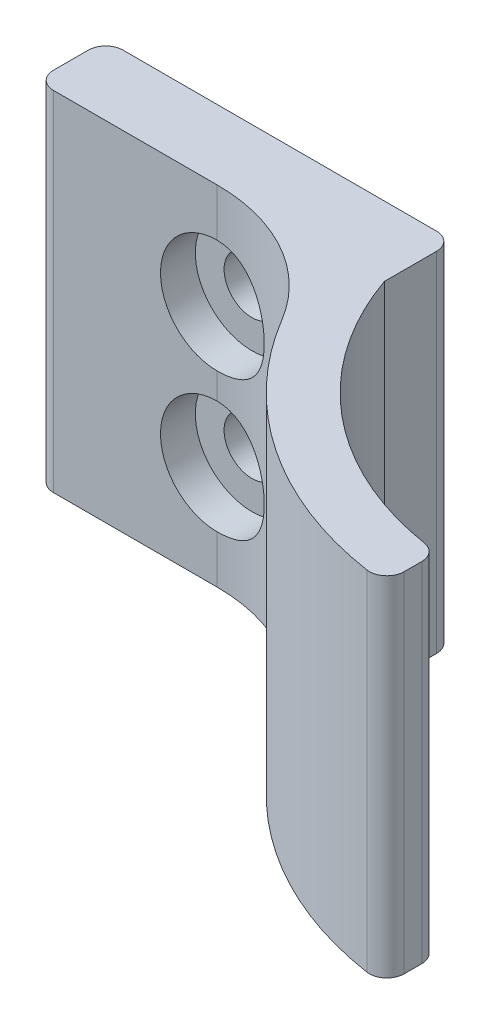
ISO-10303-21;
HEADER;
FILE_DESCRIPTION(('STEP AP214'),'2;1');
FILE_NAME('part.step','',(''),(''),'','','');
FILE_SCHEMA(('AUTOMOTIVE_DESIGN { 1 0 10303 214 1 1 1 1 }'));
ENDSEC;
DATA;
#1=APPLICATION_CONTEXT('core data for automotive mechanical design processes');
#2=APPLICATION_PROTOCOL_DEFINITION('international standard','automotive_design',2000,#1);
#3=PRODUCT_CONTEXT('',#1,'mechanical');
#4=PRODUCT('Part','Part','',(#3));
#5=PRODUCT_RELATED_PRODUCT_CATEGORY('part','',(#4));
#6=PRODUCT_DEFINITION_FORMATION('','',#4);
#7=PRODUCT_DEFINITION_CONTEXT('part definition',#1,'design');
#8=PRODUCT_DEFINITION('design','',#6,#7);
#9=PRODUCT_DEFINITION_SHAPE('','',#8);
#10=(LENGTH_UNIT() NAMED_UNIT(*) SI_UNIT(.MILLI.,.METRE.));
#11=(NAMED_UNIT(*) PLANE_ANGLE_UNIT() SI_UNIT($,.RADIAN.));
#12=(NAMED_UNIT(*) SI_UNIT($,.STERADIAN.) SOLID_ANGLE_UNIT());
#13=UNCERTAINTY_MEASURE_WITH_UNIT(LENGTH_MEASURE(1.E-05),#10,'distance_accuracy_value','');
#14=(GEOMETRIC_REPRESENTATION_CONTEXT(3) GLOBAL_UNCERTAINTY_ASSIGNED_CONTEXT((#13)) GLOBAL_UNIT_ASSIGNED_CONTEXT((#10,
#11,#12)) REPRESENTATION_CONTEXT('',''));
#15=CARTESIAN_POINT('',(0.,0.,0.));
#16=DIRECTION('',(0.,0.,1.));
#17=DIRECTION('',(1.,0.,0.));
#18=AXIS2_PLACEMENT_3D('',#15,#16,#17);
#19=CARTESIAN_POINT('',(17.,20.,-5.91607978309961));
#20=DIRECTION('',(0.,-1.,0.));
#21=DIRECTION('',(0.,0.,-1.));
#22=AXIS2_PLACEMENT_3D('',#19,#20,#21);
#23=CYLINDRICAL_SURFACE('',#22,18.);
#24=CARTESIAN_POINT('',(17.,0.,-5.91607978309961));
#25=DIRECTION('',(0.,-1.,0.));
#26=DIRECTION('',(0.,0.,1.));
#27=AXIS2_PLACEMENT_3D('',#24,#25,#26);
#28=CIRCLE('',#27,18.);
#29=CARTESIAN_POINT('',(14.1578947368421,0.,11.8581273067576));
#30=VERTEX_POINT('',#29);
#31=CARTESIAN_POINT('',(0.,0.,0.));
#32=VERTEX_POINT('',#31);
#33=EDGE_CURVE('E241',#30,#32,#28,.T.);
#34=ORIENTED_EDGE('',*,*,#33,.T.);
#35=DIRECTION('',(0.,-1.,0.));
#36=VECTOR('',#35,1.);
#37=CARTESIAN_POINT('',(0.,20.,0.));
#38=LINE('',#37,#36);
#39=CARTESIAN_POINT('',(0.,20.,0.));
#40=VERTEX_POINT('',#39);
#41=EDGE_CURVE('E335',#40,#32,#38,.T.);
#42=ORIENTED_EDGE('',*,*,#41,.F.);
#43=CARTESIAN_POINT('',(17.,20.,-5.91607978309961));
#44=DIRECTION('',(0.,-1.,0.));
#45=DIRECTION('',(0.,0.,1.));
#46=AXIS2_PLACEMENT_3D('',#43,#44,#45);
#47=CIRCLE('',#46,18.);
#48=CARTESIAN_POINT('',(14.1578947368421,20.,11.8581273067576));
#49=VERTEX_POINT('',#48);
#50=EDGE_CURVE('E207',#49,#40,#47,.T.);
#51=ORIENTED_EDGE('',*,*,#50,.F.);
#52=DIRECTION('',(0.,-1.,0.));
#53=VECTOR('',#52,1.);
#54=CARTESIAN_POINT('',(14.1578947368421,20.,11.8581273067576));
#55=LINE('',#54,#53);
#56=EDGE_CURVE('E199',#49,#30,#55,.T.);
#57=ORIENTED_EDGE('',*,*,#56,.T.);
#58=EDGE_LOOP('',(#34,#42,#51,#57));
#59=FACE_BOUND('',#58,.T.);
#60=ADVANCED_FACE('F39',(#59),#23,.F.);
#61=CARTESIAN_POINT('',(0.,20.,0.));
#62=DIRECTION('',(-1.,0.,0.));
#63=DIRECTION('',(0.,0.,1.));
#64=AXIS2_PLACEMENT_3D('',#61,#62,#63);
#65=PLANE('',#64);
#66=DIRECTION('',(0.,0.,-1.));
#67=VECTOR('',#66,1.);
#68=CARTESIAN_POINT('',(0.,0.,0.));
#69=LINE('',#68,#67);
#70=CARTESIAN_POINT('',(0.,0.,-2.99999999999999));
#71=VERTEX_POINT('',#70);
#72=EDGE_CURVE('E238',#32,#71,#69,.T.);
#73=ORIENTED_EDGE('',*,*,#72,.T.);
#74=DIRECTION('',(0.,-1.,0.));
#75=VECTOR('',#74,1.);
#76=CARTESIAN_POINT('',(0.,20.,-2.99999999999999));
#77=LINE('',#76,#75);
#78=CARTESIAN_POINT('',(0.,20.,-2.99999999999999));
#79=VERTEX_POINT('',#78);
#80=EDGE_CURVE('E346',#79,#71,#77,.T.);
#81=ORIENTED_EDGE('',*,*,#80,.F.);
#82=DIRECTION('',(0.,0.,-1.));
#83=VECTOR('',#82,1.);
#84=CARTESIAN_POINT('',(0.,20.,0.));
#85=LINE('',#84,#83);
#86=EDGE_CURVE('E276',#40,#79,#85,.T.);
#87=ORIENTED_EDGE('',*,*,#86,.F.);
#88=ORIENTED_EDGE('',*,*,#41,.T.);
#89=EDGE_LOOP('',(#73,#81,#87,#88));
#90=FACE_BOUND('',#89,.T.);
#91=ADVANCED_FACE('F324',(#90),#65,.F.);
#92=CARTESIAN_POINT('',(-1.,20.,-3.));
#93=DIRECTION('',(0.,-1.,0.));
#94=DIRECTION('',(0.,0.,-1.));
#95=AXIS2_PLACEMENT_3D('',#92,#93,#94);
#96=CYLINDRICAL_SURFACE('',#95,1.);
#97=CARTESIAN_POINT('',(-1.,0.,-3.));
#98=DIRECTION('',(0.,1.,0.));
#99=DIRECTION('',(0.,0.,1.));
#100=AXIS2_PLACEMENT_3D('',#97,#98,#99);
#101=CIRCLE('',#100,1.);
#102=CARTESIAN_POINT('',(-1.00000000000001,0.,-4.));
#103=VERTEX_POINT('',#102);
#104=EDGE_CURVE('E235',#71,#103,#101,.T.);
#105=ORIENTED_EDGE('',*,*,#104,.T.);
#106=DIRECTION('',(0.,-1.,0.));
#107=VECTOR('',#106,1.);
#108=CARTESIAN_POINT('',(-1.00000000000001,20.,-4.));
#109=LINE('',#108,#107);
#110=CARTESIAN_POINT('',(-1.00000000000001,20.,-4.));
#111=VERTEX_POINT('',#110);
#112=EDGE_CURVE('E350',#111,#103,#109,.T.);
#113=ORIENTED_EDGE('',*,*,#112,.F.);
#114=CARTESIAN_POINT('',(-1.,20.,-3.));
#115=DIRECTION('',(0.,1.,0.));
#116=DIRECTION('',(0.,0.,1.));
#117=AXIS2_PLACEMENT_3D('',#114,#115,#116);
#118=CIRCLE('',#117,1.);
#119=EDGE_CURVE('E273',#79,#111,#118,.T.);
#120=ORIENTED_EDGE('',*,*,#119,.F.);
#121=ORIENTED_EDGE('',*,*,#80,.T.);
#122=EDGE_LOOP('',(#105,#113,#120,#121));
#123=FACE_BOUND('',#122,.T.);
#124=ADVANCED_FACE('F329',(#123),#96,.T.);
#125=CARTESIAN_POINT('',(-1.00000000000001,20.,-4.));
#126=DIRECTION('',(0.,0.,1.));
#127=DIRECTION('',(1.,0.,0.));
#128=AXIS2_PLACEMENT_3D('',#125,#126,#127);
#129=PLANE('',#128);
#130=CARTESIAN_POINT('',(-9.60222555234821,14.,-4.));
#131=DIRECTION('',(0.,0.,1.));
#132=DIRECTION('',(1.,0.,0.));
#133=AXIS2_PLACEMENT_3D('',#130,#131,#132);
#134=CIRCLE('',#133,1.6);
#135=CARTESIAN_POINT('',(-8.00222555234821,14.,-4.));
#136=VERTEX_POINT('',#135);
#137=EDGE_CURVE('E162',#136,#136,#134,.T.);
#138=ORIENTED_EDGE('',*,*,#137,.T.);
#139=EDGE_LOOP('',(#138));
#140=FACE_BOUND('',#139,.T.);
#141=CARTESIAN_POINT('',(-9.60222555234821,6.,-4.));
#142=DIRECTION('',(0.,0.,1.));
#143=DIRECTION('',(1.,0.,0.));
#144=AXIS2_PLACEMENT_3D('',#141,#142,#143);
#145=CIRCLE('',#144,1.6);
#146=CARTESIAN_POINT('',(-8.00222555234821,6.,-4.));
#147=VERTEX_POINT('',#146);
#148=EDGE_CURVE('E284',#147,#147,#145,.T.);
#149=ORIENTED_EDGE('',*,*,#148,.T.);
#150=EDGE_LOOP('',(#149));
#151=FACE_BOUND('',#150,.T.);
#152=DIRECTION('',(-1.,0.,0.));
#153=VECTOR('',#152,1.);
#154=CARTESIAN_POINT('',(-1.00000000000001,0.,-4.));
#155=LINE('',#154,#153);
#156=CARTESIAN_POINT('',(-19.,0.,-4.));
#157=VERTEX_POINT('',#156);
#158=EDGE_CURVE('E232',#103,#157,#155,.T.);
#159=ORIENTED_EDGE('',*,*,#158,.T.);
#160=DIRECTION('',(0.,-1.,0.));
#161=VECTOR('',#160,1.);
#162=CARTESIAN_POINT('',(-19.,20.,-4.));
#163=LINE('',#162,#161);
#164=CARTESIAN_POINT('',(-19.,20.,-4.));
#165=VERTEX_POINT('',#164);
#166=EDGE_CURVE('E415',#165,#157,#163,.T.);
#167=ORIENTED_EDGE('',*,*,#166,.F.);
#168=DIRECTION('',(-1.,0.,0.));
#169=VECTOR('',#168,1.);
#170=CARTESIAN_POINT('',(-1.00000000000001,20.,-4.));
#171=LINE('',#170,#169);
#172=EDGE_CURVE('E270',#111,#165,#171,.T.);
#173=ORIENTED_EDGE('',*,*,#172,.F.);
#174=ORIENTED_EDGE('',*,*,#112,.T.);
#175=EDGE_LOOP('',(#159,#167,#173,#174));
#176=FACE_BOUND('',#175,.T.);
#177=ADVANCED_FACE('F425',(#140,#151,#176),#129,.F.);
#178=CARTESIAN_POINT('',(-19.,20.,-3.));
#179=DIRECTION('',(0.,-1.,0.));
#180=DIRECTION('',(0.,0.,-1.));
#181=AXIS2_PLACEMENT_3D('',#178,#179,#180);
#182=CYLINDRICAL_SURFACE('',#181,1.);
#183=CARTESIAN_POINT('',(-19.,0.,-3.));
#184=DIRECTION('',(0.,1.,0.));
#185=DIRECTION('',(0.,0.,1.));
#186=AXIS2_PLACEMENT_3D('',#183,#184,#185);
#187=CIRCLE('',#186,1.);
#188=CARTESIAN_POINT('',(-20.,0.,-2.99999999999999));
#189=VERTEX_POINT('',#188);
#190=EDGE_CURVE('E229',#157,#189,#187,.T.);
#191=ORIENTED_EDGE('',*,*,#190,.T.);
#192=DIRECTION('',(0.,-1.,0.));
#193=VECTOR('',#192,1.);
#194=CARTESIAN_POINT('',(-20.,20.,-2.99999999999999));
#195=LINE('',#194,#193);
#196=CARTESIAN_POINT('',(-20.,20.,-2.99999999999999));
#197=VERTEX_POINT('',#196);
#198=EDGE_CURVE('E411',#197,#189,#195,.T.);
#199=ORIENTED_EDGE('',*,*,#198,.F.);
#200=CARTESIAN_POINT('',(-19.,20.,-3.));
#201=DIRECTION('',(0.,1.,0.));
#202=DIRECTION('',(0.,0.,1.));
#203=AXIS2_PLACEMENT_3D('',#200,#201,#202);
#204=CIRCLE('',#203,1.);
#205=EDGE_CURVE('E267',#165,#197,#204,.T.);
#206=ORIENTED_EDGE('',*,*,#205,.F.);
#207=ORIENTED_EDGE('',*,*,#166,.T.);
#208=EDGE_LOOP('',(#191,#199,#206,#207));
#209=FACE_BOUND('',#208,.T.);
#210=ADVANCED_FACE('F432',(#209),#182,.T.);
#211=CARTESIAN_POINT('',(-20.,20.,-1.));
#212=DIRECTION('',(1.,0.,0.));
#213=DIRECTION('',(0.,0.,-1.));
#214=AXIS2_PLACEMENT_3D('',#211,#212,#213);
#215=PLANE('',#214);
#216=DIRECTION('',(0.,0.,1.));
#217=VECTOR('',#216,1.);
#218=CARTESIAN_POINT('',(-20.,0.,-1.));
#219=LINE('',#218,#217);
#220=CARTESIAN_POINT('',(-20.,0.,-1.));
#221=VERTEX_POINT('',#220);
#222=EDGE_CURVE('E226',#189,#221,#219,.T.);
#223=ORIENTED_EDGE('',*,*,#222,.T.);
#224=DIRECTION('',(0.,-1.,0.));
#225=VECTOR('',#224,1.);
#226=CARTESIAN_POINT('',(-20.,20.,-1.));
#227=LINE('',#226,#225);
#228=CARTESIAN_POINT('',(-20.,20.,-1.));
#229=VERTEX_POINT('',#228);
#230=EDGE_CURVE('E174',#229,#221,#227,.T.);
#231=ORIENTED_EDGE('',*,*,#230,.F.);
#232=DIRECTION('',(0.,0.,1.));
#233=VECTOR('',#232,1.);
#234=CARTESIAN_POINT('',(-20.,20.,-1.));
#235=LINE('',#234,#233);
#236=EDGE_CURVE('E264',#197,#229,#235,.T.);
#237=ORIENTED_EDGE('',*,*,#236,.F.);
#238=ORIENTED_EDGE('',*,*,#198,.T.);
#239=EDGE_LOOP('',(#223,#231,#237,#238));
#240=FACE_BOUND('',#239,.T.);
#241=ADVANCED_FACE('F434',(#240),#215,.F.);
#242=CARTESIAN_POINT('',(-19.,20.,-0.999999999999997));
#243=DIRECTION('',(0.,-1.,0.));
#244=DIRECTION('',(0.,0.,-1.));
#245=AXIS2_PLACEMENT_3D('',#242,#243,#244);
#246=CYLINDRICAL_SURFACE('',#245,1.);
#247=CARTESIAN_POINT('',(-19.,0.,-0.999999999999997));
#248=DIRECTION('',(0.,1.,0.));
#249=DIRECTION('',(0.,0.,1.));
#250=AXIS2_PLACEMENT_3D('',#247,#248,#249);
#251=CIRCLE('',#250,1.);
#252=CARTESIAN_POINT('',(-19.,0.,0.));
#253=VERTEX_POINT('',#252);
#254=EDGE_CURVE('E223',#221,#253,#251,.T.);
#255=ORIENTED_EDGE('',*,*,#254,.T.);
#256=DIRECTION('',(0.,-1.,0.));
#257=VECTOR('',#256,1.);
#258=CARTESIAN_POINT('',(-19.,20.,0.));
#259=LINE('',#258,#257);
#260=CARTESIAN_POINT('',(-19.,20.,0.));
#261=VERTEX_POINT('',#260);
#262=EDGE_CURVE('E168',#261,#253,#259,.T.);
#263=ORIENTED_EDGE('',*,*,#262,.F.);
#264=CARTESIAN_POINT('',(-19.,20.,-0.999999999999997));
#265=DIRECTION('',(0.,1.,0.));
#266=DIRECTION('',(0.,0.,1.));
#267=AXIS2_PLACEMENT_3D('',#264,#265,#266);
#268=CIRCLE('',#267,1.);
#269=EDGE_CURVE('E261',#229,#261,#268,.T.);
#270=ORIENTED_EDGE('',*,*,#269,.F.);
#271=ORIENTED_EDGE('',*,*,#230,.T.);
#272=EDGE_LOOP('',(#255,#263,#270,#271));
#273=FACE_BOUND('',#272,.T.);
#274=ADVANCED_FACE('F405',(#273),#246,.T.);
#275=CARTESIAN_POINT('',(-9.60222555234821,20.,0.));
#276=DIRECTION('',(0.,0.,-1.));
#277=DIRECTION('',(-1.,0.,0.));
#278=AXIS2_PLACEMENT_3D('',#275,#276,#277);
#279=PLANE('',#278);
#280=DIRECTION('',(0.,-1.,0.));
#281=VECTOR('',#280,1.);
#282=CARTESIAN_POINT('',(-9.60222555234821,20.,0.));
#283=LINE('',#282,#281);
#284=CARTESIAN_POINT('',(-9.60222555234821,10.75,0.));
#285=VERTEX_POINT('',#284);
#286=CARTESIAN_POINT('',(-9.6022255523482,9.25,0.));
#287=VERTEX_POINT('',#286);
#288=EDGE_CURVE('E159',#285,#287,#283,.T.);
#289=ORIENTED_EDGE('',*,*,#288,.F.);
#290=CARTESIAN_POINT('',(-9.60222555234821,14.,0.));
#291=DIRECTION('',(0.,0.,-1.));
#292=DIRECTION('',(-1.,0.,0.));
#293=AXIS2_PLACEMENT_3D('',#290,#291,#292);
#294=CIRCLE('',#293,3.25);
#295=CARTESIAN_POINT('',(-9.6022255523482,17.25,0.));
#296=VERTEX_POINT('',#295);
#297=EDGE_CURVE('E59',#285,#296,#294,.T.);
#298=ORIENTED_EDGE('',*,*,#297,.T.);
#299=CARTESIAN_POINT('',(-9.60222555234821,20.,0.));
#300=VERTEX_POINT('',#299);
#301=EDGE_CURVE('E157',#300,#296,#283,.T.);
#302=ORIENTED_EDGE('',*,*,#301,.F.);
#303=DIRECTION('',(1.,0.,0.));
#304=VECTOR('',#303,1.);
#305=CARTESIAN_POINT('',(-9.60222555234821,20.,0.));
#306=LINE('',#305,#304);
#307=EDGE_CURVE('E258',#261,#300,#306,.T.);
#308=ORIENTED_EDGE('',*,*,#307,.F.);
#309=ORIENTED_EDGE('',*,*,#262,.T.);
#310=DIRECTION('',(1.,0.,0.));
#311=VECTOR('',#310,1.);
#312=CARTESIAN_POINT('',(-9.60222555234821,0.,0.));
#313=LINE('',#312,#311);
#314=CARTESIAN_POINT('',(-9.60222555234821,0.,0.));
#315=VERTEX_POINT('',#314);
#316=EDGE_CURVE('E220',#253,#315,#313,.T.);
#317=ORIENTED_EDGE('',*,*,#316,.T.);
#318=CARTESIAN_POINT('',(-9.60222555234821,2.75,0.));
#319=VERTEX_POINT('',#318);
#320=EDGE_CURVE('E170',#319,#315,#283,.T.);
#321=ORIENTED_EDGE('',*,*,#320,.F.);
#322=CARTESIAN_POINT('',(-9.60222555234821,6.,0.));
#323=DIRECTION('',(0.,0.,-1.));
#324=DIRECTION('',(-1.,0.,0.));
#325=AXIS2_PLACEMENT_3D('',#322,#323,#324);
#326=CIRCLE('',#325,3.25);
#327=EDGE_CURVE('E65',#319,#287,#326,.T.);
#328=ORIENTED_EDGE('',*,*,#327,.T.);
#329=EDGE_LOOP('',(#289,#298,#302,#308,#309,#317,#321,#328));
#330=FACE_BOUND('',#329,.T.);
#331=ADVANCED_FACE('F155',(#330),#279,.F.);
#332=CARTESIAN_POINT('',(-9.6022255523482,20.,10.));
#333=DIRECTION('',(0.,-1.,0.));
#334=DIRECTION('',(0.,0.,-1.));
#335=AXIS2_PLACEMENT_3D('',#332,#333,#334);
#336=CYLINDRICAL_SURFACE('',#335,10.);
#337=ORIENTED_EDGE('',*,*,#301,.T.);
#338=CARTESIAN_POINT('',(-9.6022255523482,17.25,0.));
#339=CARTESIAN_POINT('',(-9.51329341857394,17.2500112513051,-1.11282264914781E-05));
#340=CARTESIAN_POINT('',(-9.42436827352336,17.2463499427884,0.00118607652276622));
#341=CARTESIAN_POINT('',(-9.24719660002003,17.2317695585319,0.00591437661247233));
#342=CARTESIAN_POINT('',(-9.15894992561175,17.220852090622,0.00944495491980726));
#343=CARTESIAN_POINT('',(-8.98398977741246,17.1918847345765,0.0187450735617407));
#344=CARTESIAN_POINT('',(-8.89727288731863,17.1738536424306,0.0245087128713515));
#345=CARTESIAN_POINT('',(-8.7257703103766,17.1308389775319,0.0381105907426012));
#346=CARTESIAN_POINT('',(-8.64098467087027,17.1058552345428,0.0459488801020304));
#347=CARTESIAN_POINT('',(-8.3904622302376,17.0207869190327,0.0722763218521159));
#348=CARTESIAN_POINT('',(-8.22833936515473,16.9505483294635,0.0935905361581963));
#349=CARTESIAN_POINT('',(-7.91821838046282,16.7852417878774,0.141559646535787));
#350=CARTESIAN_POINT('',(-7.77022699054168,16.6901620857607,0.168217068606139));
#351=CARTESIAN_POINT('',(-7.48762586695047,16.4745632729814,0.22503970914327));
#352=CARTESIAN_POINT('',(-7.35354355780084,16.3533729739643,0.25528554695048));
#353=CARTESIAN_POINT('',(-7.10720530342802,16.0904192167767,0.315424989463543));
#354=CARTESIAN_POINT('',(-6.99495487791784,15.948650571603,0.34531850330205));
#355=CARTESIAN_POINT('',(-6.79249587271183,15.6438597196631,0.402250049404965));
#356=CARTESIAN_POINT('',(-6.70296674113921,15.4803658139042,0.42918879553787));
#357=CARTESIAN_POINT('',(-6.55290386766946,15.1396322968542,0.475932568467015));
#358=CARTESIAN_POINT('',(-6.49236051062202,14.9623972664637,0.495739960332002));
#359=CARTESIAN_POINT('',(-6.40395344229763,14.6052258646278,0.52512922238866));
#360=CARTESIAN_POINT('',(-6.37509876130968,14.4255609567687,0.535020270951296));
#361=CARTESIAN_POINT('',(-6.34779091691797,14.0636848768588,0.544372934755628));
#362=CARTESIAN_POINT('',(-6.34932953992813,13.8814744060302,0.543837367720661));
#363=CARTESIAN_POINT('',(-6.38199411059323,13.5280338819998,0.532668652864772));
#364=CARTESIAN_POINT('',(-6.41184003555586,13.3566693598013,0.522472371493103));
#365=CARTESIAN_POINT('',(-6.4981883627115,13.021528311045,0.493844032955588));
#366=CARTESIAN_POINT('',(-6.55469349097933,12.8577525623695,0.47541113355283));
#367=CARTESIAN_POINT('',(-6.69362194383781,12.5394690606422,0.432065508437381));
#368=CARTESIAN_POINT('',(-6.77643391071219,12.3851445969725,0.407056655200444));
#369=CARTESIAN_POINT('',(-6.96535214961097,12.09217309776,0.353419166342113));
#370=CARTESIAN_POINT('',(-7.07146469616258,11.953530300341,0.324789556582834));
#371=CARTESIAN_POINT('',(-7.31017329563304,11.6886553593681,0.265406096653192));
#372=CARTESIAN_POINT('',(-7.44381842281442,11.563374219297,0.234617164205408));
#373=CARTESIAN_POINT('',(-7.73059429488194,11.3367443492728,0.17562044289375));
#374=CARTESIAN_POINT('',(-7.88373006723406,11.2354018134337,0.147413323227847));
#375=CARTESIAN_POINT('',(-8.20729240354845,11.0587622515606,0.0964088519237047));
#376=CARTESIAN_POINT('',(-8.37786962723737,10.9837222275642,0.0736655288042173));
#377=CARTESIAN_POINT('',(-8.64176868772571,10.8937651815659,0.0458343749978532));
#378=CARTESIAN_POINT('',(-8.73106181115526,10.867548599635,0.0376052888312919));
#379=CARTESIAN_POINT('',(-8.91172909202639,10.8228383037097,0.023457491865331));
#380=CARTESIAN_POINT('',(-9.00310230102589,10.8043411414837,0.0175377495691913));
#381=CARTESIAN_POINT('',(-9.17897030230539,10.7765614465614,0.00860906052130956));
#382=CARTESIAN_POINT('',(-9.26334858755738,10.7666022449501,0.00538697652915421));
#383=CARTESIAN_POINT('',(-9.43255711529449,10.7533220186246,0.00107953239249905));
#384=CARTESIAN_POINT('',(-9.51738653147617,10.7499914506591,-8.89953919593178E-06));
#385=CARTESIAN_POINT('',(-9.6022255523482,10.75,0.));
#386=B_SPLINE_CURVE_WITH_KNOTS('',3,(#338,#339,#340,#341,#342,#343,#344,#345,#346,#347,#348,
#349,#350,#351,#352,#353,#354,#355,#356,#357,#358,#359,#360,#361,#362,#363,#364,#365,#366,#367,
#368,#369,#370,#371,#372,#373,#374,#375,#376,#377,#378,#379,#380,#381,#382,#383,#384,#385),
.UNSPECIFIED.,.F.,.F.,(4,2,2,2,2,2,2,2,2,2,2,2,2,2,2,2,2,2,2,2,2,2,2,4),(0.,0.266701097613439,
0.533343118921864,0.799285273220844,1.06523393971388,1.59646784402707,2.12795348376492,
2.67521100352203,3.22260670599161,3.78483053108336,4.34686772605416,4.89077883063946,
5.43454294891666,5.95483514075891,6.47518054735533,7.00360176396624,7.53216545206592,
8.08683165940453,8.6416412297971,9.20172989144069,9.48170161367223,9.76154813952839,
10.0163424061384,10.2707695790362),.UNSPECIFIED.);
#387=EDGE_CURVE('E11',#296,#285,#386,.T.);
#388=ORIENTED_EDGE('',*,*,#387,.T.);
#389=ORIENTED_EDGE('',*,*,#288,.T.);
#390=CARTESIAN_POINT('',(-9.6022255523482,9.25,0.));
#391=CARTESIAN_POINT('',(-9.51329341857394,9.25001125130508,-1.11282264940276E-05));
#392=CARTESIAN_POINT('',(-9.42436827352336,9.24634994278835,0.00118607652276422));
#393=CARTESIAN_POINT('',(-9.24719660002003,9.23176955853191,0.0059143766124724));
#394=CARTESIAN_POINT('',(-9.15894992561175,9.22085209062202,0.00944495491980882));
#395=CARTESIAN_POINT('',(-8.98398977741246,9.19188473457652,0.018745073561741));
#396=CARTESIAN_POINT('',(-8.89727288731863,9.17385364243063,0.024508712871349));
#397=CARTESIAN_POINT('',(-8.7257703103766,9.13083897753194,0.0381105907425981));
#398=CARTESIAN_POINT('',(-8.64098467087027,9.10585523454277,0.0459488801020294));
#399=CARTESIAN_POINT('',(-8.3904622302376,9.02078691903271,0.0722763218521179));
#400=CARTESIAN_POINT('',(-8.22833936515473,8.9505483294635,0.0935905361581959));
#401=CARTESIAN_POINT('',(-7.91821838046282,8.78524178787738,0.141559646535787));
#402=CARTESIAN_POINT('',(-7.77022699054169,8.69016208576073,0.16821706860614));
#403=CARTESIAN_POINT('',(-7.48762586695047,8.47456327298137,0.225039709143272));
#404=CARTESIAN_POINT('',(-7.35354355780084,8.35337297396434,0.25528554695048));
#405=CARTESIAN_POINT('',(-7.10720530342802,8.09041921677671,0.315424989463542));
#406=CARTESIAN_POINT('',(-6.99495487791784,7.94865057160298,0.345318503302049));
#407=CARTESIAN_POINT('',(-6.79249587271183,7.64385971966311,0.402250049404965));
#408=CARTESIAN_POINT('',(-6.70296674113921,7.48036581390422,0.42918879553787));
#409=CARTESIAN_POINT('',(-6.55290386766946,7.13963229685422,0.475932568467014));
#410=CARTESIAN_POINT('',(-6.49236051062202,6.96239726646366,0.495739960332002));
#411=CARTESIAN_POINT('',(-6.40395344229763,6.60522586462782,0.525129222388659));
#412=CARTESIAN_POINT('',(-6.37509876130968,6.42556095676871,0.535020270951296));
#413=CARTESIAN_POINT('',(-6.34779091691797,6.06368487685879,0.544372934755628));
#414=CARTESIAN_POINT('',(-6.34932953992813,5.88147440603016,0.543837367720661));
#415=CARTESIAN_POINT('',(-6.38199411059323,5.5280338819998,0.532668652864772));
#416=CARTESIAN_POINT('',(-6.41184003555586,5.35666935980126,0.522472371493103));
#417=CARTESIAN_POINT('',(-6.4981883627115,5.02152831104501,0.493844032955588));
#418=CARTESIAN_POINT('',(-6.55469349097933,4.85775256236947,0.47541113355283));
#419=CARTESIAN_POINT('',(-6.69362194383781,4.53946906064219,0.432065508437381));
#420=CARTESIAN_POINT('',(-6.77643391071219,4.38514459697248,0.407056655200444));
#421=CARTESIAN_POINT('',(-6.96535214961097,4.09217309775996,0.353419166342112));
#422=CARTESIAN_POINT('',(-7.07146469616258,3.95353030034099,0.324789556582834));
#423=CARTESIAN_POINT('',(-7.31017329563304,3.68865535936814,0.265406096653192));
#424=CARTESIAN_POINT('',(-7.44381842281442,3.56337421929699,0.234617164205408));
#425=CARTESIAN_POINT('',(-7.73059429488194,3.33674434927281,0.17562044289375));
#426=CARTESIAN_POINT('',(-7.88373006723406,3.23540181343367,0.147413323227846));
#427=CARTESIAN_POINT('',(-8.20729240354845,3.05876225156064,0.096408851923705));
#428=CARTESIAN_POINT('',(-8.37786962723737,2.9837222275642,0.0736655288042187));
#429=CARTESIAN_POINT('',(-8.64176868772571,2.89376518156593,0.0458343749978545));
#430=CARTESIAN_POINT('',(-8.73106181115526,2.86754859963503,0.0376052888312928));
#431=CARTESIAN_POINT('',(-8.91172909202639,2.82283830370973,0.0234574918653312));
#432=CARTESIAN_POINT('',(-9.00310230102588,2.80434114148371,0.017537749569191));
#433=CARTESIAN_POINT('',(-9.17897030230539,2.77656144656137,0.00860906052130893));
#434=CARTESIAN_POINT('',(-9.26334858755738,2.7666022449501,0.00538697652915364));
#435=CARTESIAN_POINT('',(-9.43255711529448,2.75332201862458,0.0010795323924986));
#436=CARTESIAN_POINT('',(-9.51738653147617,2.74999145065914,-8.89953919633014E-06));
#437=CARTESIAN_POINT('',(-9.6022255523482,2.75,0.));
#438=B_SPLINE_CURVE_WITH_KNOTS('',3,(#390,#391,#392,#393,#394,#395,#396,#397,#398,#399,#400,
#401,#402,#403,#404,#405,#406,#407,#408,#409,#410,#411,#412,#413,#414,#415,#416,#417,#418,#419,
#420,#421,#422,#423,#424,#425,#426,#427,#428,#429,#430,#431,#432,#433,#434,#435,#436,#437),
.UNSPECIFIED.,.F.,.F.,(4,2,2,2,2,2,2,2,2,2,2,2,2,2,2,2,2,2,2,2,2,2,2,4),(0.,0.266701097613439,
0.533343118921863,0.799285273220844,1.06523393971388,1.59646784402707,2.12795348376492,
2.67521100352203,3.22260670599161,3.78483053108336,4.34686772605416,4.89077883063946,
5.43454294891666,5.95483514075891,6.47518054735533,7.00360176396624,7.53216545206592,
8.08683165940453,8.64164122979709,9.20172989144069,9.48170161367223,9.76154813952839,
10.0163424061384,10.2707695790362),.UNSPECIFIED.);
#439=EDGE_CURVE('E53',#287,#319,#438,.T.);
#440=ORIENTED_EDGE('',*,*,#439,.T.);
#441=ORIENTED_EDGE('',*,*,#320,.T.);
#442=CARTESIAN_POINT('',(-9.6022255523482,0.,10.));
#443=DIRECTION('',(0.,-1.,0.));
#444=DIRECTION('',(0.,0.,1.));
#445=AXIS2_PLACEMENT_3D('',#442,#443,#444);
#446=CIRCLE('',#445,10.);
#447=CARTESIAN_POINT('',(-1.02086247094555,0.,4.86578071512916));
#448=VERTEX_POINT('',#447);
#449=EDGE_CURVE('E217',#315,#448,#446,.T.);
#450=ORIENTED_EDGE('',*,*,#449,.T.);
#451=DIRECTION('',(0.,-1.,0.));
#452=VECTOR('',#451,1.);
#453=CARTESIAN_POINT('',(-1.02086247094555,20.,4.86578071512916));
#454=LINE('',#453,#452);
#455=CARTESIAN_POINT('',(-1.02086247094555,20.,4.86578071512916));
#456=VERTEX_POINT('',#455);
#457=EDGE_CURVE('E178',#456,#448,#454,.T.);
#458=ORIENTED_EDGE('',*,*,#457,.F.);
#459=CARTESIAN_POINT('',(-9.6022255523482,20.,10.));
#460=DIRECTION('',(0.,-1.,0.));
#461=DIRECTION('',(0.,0.,1.));
#462=AXIS2_PLACEMENT_3D('',#459,#460,#461);
#463=CIRCLE('',#462,10.);
#464=EDGE_CURVE('E166',#300,#456,#463,.T.);
#465=ORIENTED_EDGE('',*,*,#464,.F.);
#466=EDGE_LOOP('',(#337,#388,#389,#440,#441,#450,#458,#465));
#467=FACE_BOUND('',#466,.T.);
#468=ADVANCED_FACE('F164',(#467),#336,.F.);
#469=CARTESIAN_POINT('',(17.,20.,-5.91607978309961));
#470=DIRECTION('',(0.,-1.,0.));
#471=DIRECTION('',(0.,0.,-1.));
#472=AXIS2_PLACEMENT_3D('',#469,#470,#471);
#473=CYLINDRICAL_SURFACE('',#472,21.);
#474=CARTESIAN_POINT('',(17.,0.,-5.91607978309961));
#475=DIRECTION('',(0.,1.,0.));
#476=DIRECTION('',(0.,0.,1.));
#477=AXIS2_PLACEMENT_3D('',#474,#475,#476);
#478=CIRCLE('',#477,21.);
#479=CARTESIAN_POINT('',(13.85,0.,14.8463261468498));
#480=VERTEX_POINT('',#479);
#481=EDGE_CURVE('E214',#448,#480,#478,.T.);
#482=ORIENTED_EDGE('',*,*,#481,.T.);
#483=DIRECTION('',(0.,-1.,0.));
#484=VECTOR('',#483,1.);
#485=CARTESIAN_POINT('',(13.85,20.,14.8463261468498));
#486=LINE('',#485,#484);
#487=CARTESIAN_POINT('',(13.85,20.,14.8463261468498));
#488=VERTEX_POINT('',#487);
#489=EDGE_CURVE('E183',#488,#480,#486,.T.);
#490=ORIENTED_EDGE('',*,*,#489,.F.);
#491=CARTESIAN_POINT('',(17.,20.,-5.91607978309961));
#492=DIRECTION('',(0.,1.,0.));
#493=DIRECTION('',(0.,0.,1.));
#494=AXIS2_PLACEMENT_3D('',#491,#492,#493);
#495=CIRCLE('',#494,21.);
#496=EDGE_CURVE('E253',#456,#488,#495,.T.);
#497=ORIENTED_EDGE('',*,*,#496,.F.);
#498=ORIENTED_EDGE('',*,*,#457,.T.);
#499=EDGE_LOOP('',(#482,#490,#497,#498));
#500=FACE_BOUND('',#499,.T.);
#501=ADVANCED_FACE('F385',(#500),#473,.T.);
#502=CARTESIAN_POINT('',(14.,20.,13.8576401501856));
#503=DIRECTION('',(0.,-1.,0.));
#504=DIRECTION('',(0.,0.,-1.));
#505=AXIS2_PLACEMENT_3D('',#502,#503,#504);
#506=CYLINDRICAL_SURFACE('',#505,1.);
#507=CARTESIAN_POINT('',(14.,0.,13.8576401501856));
#508=DIRECTION('',(0.,1.,0.));
#509=DIRECTION('',(0.,0.,-1.));
#510=AXIS2_PLACEMENT_3D('',#507,#508,#509);
#511=CIRCLE('',#510,1.);
#512=CARTESIAN_POINT('',(15.,0.,13.8576401501856));
#513=VERTEX_POINT('',#512);
#514=EDGE_CURVE('E211',#480,#513,#511,.T.);
#515=ORIENTED_EDGE('',*,*,#514,.T.);
#516=DIRECTION('',(0.,-1.,0.));
#517=VECTOR('',#516,1.);
#518=CARTESIAN_POINT('',(15.,20.,13.8576401501856));
#519=LINE('',#518,#517);
#520=CARTESIAN_POINT('',(15.,20.,13.8576401501856));
#521=VERTEX_POINT('',#520);
#522=EDGE_CURVE('E189',#521,#513,#519,.T.);
#523=ORIENTED_EDGE('',*,*,#522,.F.);
#524=CARTESIAN_POINT('',(14.,20.,13.8576401501856));
#525=DIRECTION('',(0.,1.,0.));
#526=DIRECTION('',(0.,0.,-1.));
#527=AXIS2_PLACEMENT_3D('',#524,#525,#526);
#528=CIRCLE('',#527,1.);
#529=EDGE_CURVE('E250',#488,#521,#528,.T.);
#530=ORIENTED_EDGE('',*,*,#529,.F.);
#531=ORIENTED_EDGE('',*,*,#489,.T.);
#532=EDGE_LOOP('',(#515,#523,#530,#531));
#533=FACE_BOUND('',#532,.T.);
#534=ADVANCED_FACE('F382',(#533),#506,.T.);
#535=CARTESIAN_POINT('',(15.,20.,12.8455832561941));
#536=DIRECTION('',(-1.,0.,0.));
#537=DIRECTION('',(0.,0.,1.));
#538=AXIS2_PLACEMENT_3D('',#535,#536,#537);
#539=PLANE('',#538);
#540=DIRECTION('',(0.,0.,-1.));
#541=VECTOR('',#540,1.);
#542=CARTESIAN_POINT('',(15.,0.,12.8455832561941));
#543=LINE('',#542,#541);
#544=CARTESIAN_POINT('',(15.,0.,12.8455832561941));
#545=VERTEX_POINT('',#544);
#546=EDGE_CURVE('E208',#513,#545,#543,.T.);
#547=ORIENTED_EDGE('',*,*,#546,.T.);
#548=DIRECTION('',(0.,-1.,0.));
#549=VECTOR('',#548,1.);
#550=CARTESIAN_POINT('',(15.,20.,12.8455832561941));
#551=LINE('',#550,#549);
#552=CARTESIAN_POINT('',(15.,20.,12.8455832561941));
#553=VERTEX_POINT('',#552);
#554=EDGE_CURVE('E195',#553,#545,#551,.T.);
#555=ORIENTED_EDGE('',*,*,#554,.F.);
#556=DIRECTION('',(0.,0.,-1.));
#557=VECTOR('',#556,1.);
#558=CARTESIAN_POINT('',(15.,20.,12.8455832561941));
#559=LINE('',#558,#557);
#560=EDGE_CURVE('E247',#521,#553,#559,.T.);
#561=ORIENTED_EDGE('',*,*,#560,.F.);
#562=ORIENTED_EDGE('',*,*,#522,.T.);
#563=EDGE_LOOP('',(#547,#555,#561,#562));
#564=FACE_BOUND('',#563,.T.);
#565=ADVANCED_FACE('F378',(#564),#539,.F.);
#566=CARTESIAN_POINT('',(14.,20.,12.8455832561941));
#567=DIRECTION('',(0.,-1.,0.));
#568=DIRECTION('',(0.,0.,-1.));
#569=AXIS2_PLACEMENT_3D('',#566,#567,#568);
#570=CYLINDRICAL_SURFACE('',#569,1.);
#571=CARTESIAN_POINT('',(14.,0.,12.8455832561941));
#572=DIRECTION('',(0.,1.,0.));
#573=DIRECTION('',(0.,0.,1.));
#574=AXIS2_PLACEMENT_3D('',#571,#572,#573);
#575=CIRCLE('',#574,1.);
#576=EDGE_CURVE('E204',#545,#30,#575,.T.);
#577=ORIENTED_EDGE('',*,*,#576,.T.);
#578=ORIENTED_EDGE('',*,*,#56,.F.);
#579=CARTESIAN_POINT('',(14.,20.,12.8455832561941));
#580=DIRECTION('',(0.,1.,0.));
#581=DIRECTION('',(0.,0.,1.));
#582=AXIS2_PLACEMENT_3D('',#579,#580,#581);
#583=CIRCLE('',#582,1.);
#584=EDGE_CURVE('E203',#553,#49,#583,.T.);
#585=ORIENTED_EDGE('',*,*,#584,.F.);
#586=ORIENTED_EDGE('',*,*,#554,.T.);
#587=EDGE_LOOP('',(#577,#578,#585,#586));
#588=FACE_BOUND('',#587,.T.);
#589=ADVANCED_FACE('F372',(#588),#570,.T.);
#590=CARTESIAN_POINT('',(17.,20.,-5.91607978309961));
#591=DIRECTION('',(0.,1.,0.));
#592=DIRECTION('',(0.,0.,1.));
#593=AXIS2_PLACEMENT_3D('',#590,#591,#592);
#594=PLANE('',#593);
#595=ORIENTED_EDGE('',*,*,#50,.T.);
#596=ORIENTED_EDGE('',*,*,#86,.T.);
#597=ORIENTED_EDGE('',*,*,#119,.T.);
#598=ORIENTED_EDGE('',*,*,#172,.T.);
#599=ORIENTED_EDGE('',*,*,#205,.T.);
#600=ORIENTED_EDGE('',*,*,#236,.T.);
#601=ORIENTED_EDGE('',*,*,#269,.T.);
#602=ORIENTED_EDGE('',*,*,#307,.T.);
#603=ORIENTED_EDGE('',*,*,#464,.T.);
#604=ORIENTED_EDGE('',*,*,#496,.T.);
#605=ORIENTED_EDGE('',*,*,#529,.T.);
#606=ORIENTED_EDGE('',*,*,#560,.T.);
#607=ORIENTED_EDGE('',*,*,#584,.T.);
#608=EDGE_LOOP('',(#595,#596,#597,#598,#599,#600,#601,#602,#603,#604,#605,#606,#607));
#609=FACE_BOUND('',#608,.T.);
#610=ADVANCED_FACE('F369',(#609),#594,.T.);
#611=CARTESIAN_POINT('',(17.,0.,-5.91607978309961));
#612=DIRECTION('',(0.,1.,0.));
#613=DIRECTION('',(0.,0.,1.));
#614=AXIS2_PLACEMENT_3D('',#611,#612,#613);
#615=PLANE('',#614);
#616=ORIENTED_EDGE('',*,*,#33,.F.);
#617=ORIENTED_EDGE('',*,*,#576,.F.);
#618=ORIENTED_EDGE('',*,*,#546,.F.);
#619=ORIENTED_EDGE('',*,*,#514,.F.);
#620=ORIENTED_EDGE('',*,*,#481,.F.);
#621=ORIENTED_EDGE('',*,*,#449,.F.);
#622=ORIENTED_EDGE('',*,*,#316,.F.);
#623=ORIENTED_EDGE('',*,*,#254,.F.);
#624=ORIENTED_EDGE('',*,*,#222,.F.);
#625=ORIENTED_EDGE('',*,*,#190,.F.);
#626=ORIENTED_EDGE('',*,*,#158,.F.);
#627=ORIENTED_EDGE('',*,*,#104,.F.);
#628=ORIENTED_EDGE('',*,*,#72,.F.);
#629=EDGE_LOOP('',(#616,#617,#618,#619,#620,#621,#622,#623,#624,#625,#626,#627,#628));
#630=FACE_BOUND('',#629,.T.);
#631=ADVANCED_FACE('F339',(#630),#615,.F.);
#632=CARTESIAN_POINT('',(-9.60222555234821,6.,2.));
#633=DIRECTION('',(0.,0.,1.));
#634=DIRECTION('',(1.,0.,0.));
#635=AXIS2_PLACEMENT_3D('',#632,#633,#634);
#636=CYLINDRICAL_SURFACE('',#635,3.25);
#637=CARTESIAN_POINT('',(-9.60222555234821,6.,-2.));
#638=DIRECTION('',(0.,0.,1.));
#639=DIRECTION('',(1.,0.,0.));
#640=AXIS2_PLACEMENT_3D('',#637,#638,#639);
#641=CIRCLE('',#640,3.25);
#642=CARTESIAN_POINT('',(-6.35222555234821,6.,-2.));
#643=VERTEX_POINT('',#642);
#644=EDGE_CURVE('E161',#643,#643,#641,.T.);
#645=ORIENTED_EDGE('',*,*,#644,.F.);
#646=EDGE_LOOP('',(#645));
#647=FACE_BOUND('',#646,.T.);
#648=ORIENTED_EDGE('',*,*,#439,.F.);
#649=ORIENTED_EDGE('',*,*,#327,.F.);
#650=EDGE_LOOP('',(#648,#649));
#651=FACE_BOUND('',#650,.T.);
#652=ADVANCED_FACE('F361',(#647,#651),#636,.F.);
#653=CARTESIAN_POINT('',(-9.60222555234821,6.,2.));
#654=DIRECTION('',(0.,0.,1.));
#655=DIRECTION('',(1.,0.,0.));
#656=AXIS2_PLACEMENT_3D('',#653,#654,#655);
#657=CYLINDRICAL_SURFACE('',#656,1.6);
#658=ORIENTED_EDGE('',*,*,#148,.F.);
#659=EDGE_LOOP('',(#658));
#660=FACE_BOUND('',#659,.T.);
#661=CARTESIAN_POINT('',(-9.60222555234821,6.,-2.));
#662=DIRECTION('',(0.,0.,1.));
#663=DIRECTION('',(1.,0.,0.));
#664=AXIS2_PLACEMENT_3D('',#661,#662,#663);
#665=CIRCLE('',#664,1.6);
#666=CARTESIAN_POINT('',(-8.00222555234821,6.,-2.));
#667=VERTEX_POINT('',#666);
#668=EDGE_CURVE('E288',#667,#667,#665,.T.);
#669=ORIENTED_EDGE('',*,*,#668,.T.);
#670=EDGE_LOOP('',(#669));
#671=FACE_BOUND('',#670,.T.);
#672=ADVANCED_FACE('F318',(#660,#671),#657,.F.);
#673=CARTESIAN_POINT('',(-8.00222555234821,6.,-2.));
#674=DIRECTION('',(0.,0.,-1.));
#675=DIRECTION('',(-1.,0.,0.));
#676=AXIS2_PLACEMENT_3D('',#673,#674,#675);
#677=PLANE('',#676);
#678=ORIENTED_EDGE('',*,*,#668,.F.);
#679=EDGE_LOOP('',(#678));
#680=FACE_BOUND('',#679,.T.);
#681=ORIENTED_EDGE('',*,*,#644,.T.);
#682=EDGE_LOOP('',(#681));
#683=FACE_BOUND('',#682,.T.);
#684=ADVANCED_FACE('F311',(#680,#683),#677,.F.);
#685=CARTESIAN_POINT('',(-9.60222555234821,14.,2.));
#686=DIRECTION('',(0.,0.,1.));
#687=DIRECTION('',(1.,0.,0.));
#688=AXIS2_PLACEMENT_3D('',#685,#686,#687);
#689=CYLINDRICAL_SURFACE('',#688,3.25);
#690=CARTESIAN_POINT('',(-9.60222555234821,14.,-2.));
#691=DIRECTION('',(0.,0.,1.));
#692=DIRECTION('',(1.,0.,0.));
#693=AXIS2_PLACEMENT_3D('',#690,#691,#692);
#694=CIRCLE('',#693,3.25);
#695=CARTESIAN_POINT('',(-6.35222555234821,14.,-2.));
#696=VERTEX_POINT('',#695);
#697=EDGE_CURVE('E302',#696,#696,#694,.T.);
#698=ORIENTED_EDGE('',*,*,#697,.F.);
#699=EDGE_LOOP('',(#698));
#700=FACE_BOUND('',#699,.T.);
#701=ORIENTED_EDGE('',*,*,#387,.F.);
#702=ORIENTED_EDGE('',*,*,#297,.F.);
#703=EDGE_LOOP('',(#701,#702));
#704=FACE_BOUND('',#703,.T.);
#705=ADVANCED_FACE('F149',(#700,#704),#689,.F.);
#706=CARTESIAN_POINT('',(-9.60222555234821,14.,2.));
#707=DIRECTION('',(0.,0.,1.));
#708=DIRECTION('',(1.,0.,0.));
#709=AXIS2_PLACEMENT_3D('',#706,#707,#708);
#710=CYLINDRICAL_SURFACE('',#709,1.6);
#711=ORIENTED_EDGE('',*,*,#137,.F.);
#712=EDGE_LOOP('',(#711));
#713=FACE_BOUND('',#712,.T.);
#714=CARTESIAN_POINT('',(-9.60222555234821,14.,-2.));
#715=DIRECTION('',(0.,0.,1.));
#716=DIRECTION('',(1.,0.,0.));
#717=AXIS2_PLACEMENT_3D('',#714,#715,#716);
#718=CIRCLE('',#717,1.6);
#719=CARTESIAN_POINT('',(-8.00222555234821,14.,-2.));
#720=VERTEX_POINT('',#719);
#721=EDGE_CURVE('E298',#720,#720,#718,.T.);
#722=ORIENTED_EDGE('',*,*,#721,.T.);
#723=EDGE_LOOP('',(#722));
#724=FACE_BOUND('',#723,.T.);
#725=ADVANCED_FACE('F310',(#713,#724),#710,.F.);
#726=CARTESIAN_POINT('',(-8.00222555234821,14.,-2.));
#727=DIRECTION('',(0.,0.,-1.));
#728=DIRECTION('',(-1.,0.,0.));
#729=AXIS2_PLACEMENT_3D('',#726,#727,#728);
#730=PLANE('',#729);
#731=ORIENTED_EDGE('',*,*,#721,.F.);
#732=EDGE_LOOP('',(#731));
#733=FACE_BOUND('',#732,.T.);
#734=ORIENTED_EDGE('',*,*,#697,.T.);
#735=EDGE_LOOP('',(#734));
#736=FACE_BOUND('',#735,.T.);
#737=ADVANCED_FACE('F307',(#733,#736),#730,.F.);
#738=CLOSED_SHELL('',(#60,#91,#124,#177,#210,#241,#274,#331,#468,#501,#534,#565,#589,#610,#631,
#652,#672,#684,#705,#725,#737));
#739=MANIFOLD_SOLID_BREP('B2',#738);
#740=ADVANCED_BREP_SHAPE_REPRESENTATION('',(#18,#739),#14);
#741=SHAPE_DEFINITION_REPRESENTATION(#9,#740);
ENDSEC;
END-ISO-10303-21;
